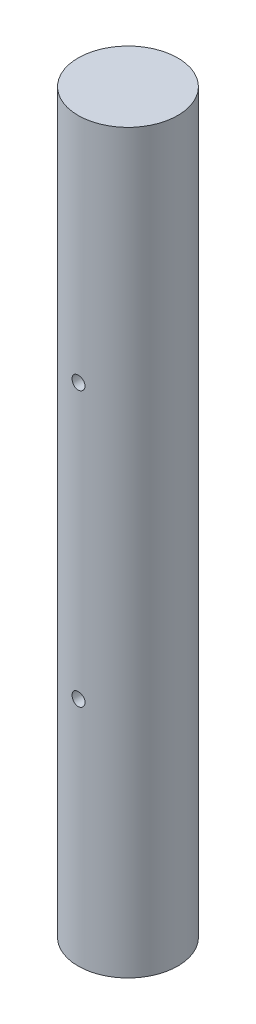
ISO-10303-21;
HEADER;
FILE_DESCRIPTION(('STEP AP214'),'2;1');
FILE_NAME('part.step','',(''),(''),'','','');
FILE_SCHEMA(('AUTOMOTIVE_DESIGN { 1 0 10303 214 1 1 1 1 }'));
ENDSEC;
DATA;
#1=APPLICATION_CONTEXT('core data for automotive mechanical design processes');
#2=APPLICATION_PROTOCOL_DEFINITION('international standard','automotive_design',2000,#1);
#3=PRODUCT_CONTEXT('',#1,'mechanical');
#4=PRODUCT('Part','Part','',(#3));
#5=PRODUCT_RELATED_PRODUCT_CATEGORY('part','',(#4));
#6=PRODUCT_DEFINITION_FORMATION('','',#4);
#7=PRODUCT_DEFINITION_CONTEXT('part definition',#1,'design');
#8=PRODUCT_DEFINITION('design','',#6,#7);
#9=PRODUCT_DEFINITION_SHAPE('','',#8);
#10=(LENGTH_UNIT() NAMED_UNIT(*) SI_UNIT(.MILLI.,.METRE.));
#11=(NAMED_UNIT(*) PLANE_ANGLE_UNIT() SI_UNIT($,.RADIAN.));
#12=(NAMED_UNIT(*) SI_UNIT($,.STERADIAN.) SOLID_ANGLE_UNIT());
#13=UNCERTAINTY_MEASURE_WITH_UNIT(LENGTH_MEASURE(1.E-05),#10,'distance_accuracy_value','');
#14=(GEOMETRIC_REPRESENTATION_CONTEXT(3) GLOBAL_UNCERTAINTY_ASSIGNED_CONTEXT((#13)) GLOBAL_UNIT_ASSIGNED_CONTEXT((#10,
#11,#12)) REPRESENTATION_CONTEXT('',''));
#15=CARTESIAN_POINT('',(0.,0.,0.));
#16=DIRECTION('',(0.,0.,1.));
#17=DIRECTION('',(1.,0.,0.));
#18=AXIS2_PLACEMENT_3D('',#15,#16,#17);
#19=CARTESIAN_POINT('',(0.,170.,0.));
#20=DIRECTION('',(0.,-1.,0.));
#21=DIRECTION('',(0.,0.,-1.));
#22=AXIS2_PLACEMENT_3D('',#19,#20,#21);
#23=CYLINDRICAL_SURFACE('',#22,11.5);
#24=CARTESIAN_POINT('',(0.,170.,0.));
#25=DIRECTION('',(0.,1.,0.));
#26=DIRECTION('',(0.,0.,1.));
#27=AXIS2_PLACEMENT_3D('',#24,#25,#26);
#28=CIRCLE('',#27,11.5);
#29=CARTESIAN_POINT('',(0.,170.,11.5));
#30=VERTEX_POINT('',#29);
#31=EDGE_CURVE('E10',#30,#30,#28,.T.);
#32=ORIENTED_EDGE('',*,*,#31,.F.);
#33=EDGE_LOOP('',(#32));
#34=FACE_BOUND('',#33,.T.);
#35=CARTESIAN_POINT('',(0.,0.,0.));
#36=DIRECTION('',(0.,1.,0.));
#37=DIRECTION('',(0.,0.,1.));
#38=AXIS2_PLACEMENT_3D('',#35,#36,#37);
#39=CIRCLE('',#38,11.5);
#40=CARTESIAN_POINT('',(0.,0.,11.5));
#41=VERTEX_POINT('',#40);
#42=EDGE_CURVE('E40',#41,#41,#39,.T.);
#43=ORIENTED_EDGE('',*,*,#42,.T.);
#44=EDGE_LOOP('',(#43));
#45=FACE_BOUND('',#44,.T.);
#46=CARTESIAN_POINT('',(-1.5,116.62,11.4017542509914));
#47=CARTESIAN_POINT('',(-1.4999964530145,116.703870253946,11.4017555010927));
#48=CARTESIAN_POINT('',(-1.49294203416221,116.787792174681,11.4026896606142));
#49=CARTESIAN_POINT('',(-1.46491333453698,116.953298276185,11.4063237260242));
#50=CARTESIAN_POINT('',(-1.44392470388228,117.034879956455,11.4090254521656));
#51=CARTESIAN_POINT('',(-1.3886587589991,117.193285481374,11.4158835494573));
#52=CARTESIAN_POINT('',(-1.3543907018073,117.27011259724,11.4200389070908));
#53=CARTESIAN_POINT('',(-1.27355889313978,117.416912256068,11.4293348464697));
#54=CARTESIAN_POINT('',(-1.22699716043964,117.486885921868,11.4344752664174));
#55=CARTESIAN_POINT('',(-1.12259656958886,117.618431613016,11.445197137233));
#56=CARTESIAN_POINT('',(-1.06469780379541,117.679955915402,11.450780832969));
#57=CARTESIAN_POINT('',(-0.939395748791598,117.792443921662,11.4617399588797));
#58=CARTESIAN_POINT('',(-0.871991977267106,117.843407089307,11.4671153784682));
#59=CARTESIAN_POINT('',(-0.729292001348488,117.933498448519,11.4770753814867));
#60=CARTESIAN_POINT('',(-0.653968201092626,117.972583280349,11.4816570418954));
#61=CARTESIAN_POINT('',(-0.49775603705431,118.037530666644,11.4894885821545));
#62=CARTESIAN_POINT('',(-0.416867897538944,118.06339375365,11.4927385156426));
#63=CARTESIAN_POINT('',(-0.252312093764229,118.101020439311,11.4975246059022));
#64=CARTESIAN_POINT('',(-0.168662889559627,118.112863522644,11.4990704204953));
#65=CARTESIAN_POINT('',(-0.000551051593625695,118.12236044931,11.5003071067839));
#66=CARTESIAN_POINT('',(0.0839115473355974,118.120014897574,11.4999980575609));
#67=CARTESIAN_POINT('',(0.250711499958829,118.10126463822,11.4975676318304));
#68=CARTESIAN_POINT('',(0.333058646852877,118.084945419878,11.495457275758));
#69=CARTESIAN_POINT('',(0.493835455554841,118.038844819273,11.4896737037343));
#70=CARTESIAN_POINT('',(0.57226503731604,118.009063162061,11.4860004558634));
#71=CARTESIAN_POINT('',(0.723243851165385,117.936792854226,11.4774848372199));
#72=CARTESIAN_POINT('',(0.795775273641194,117.894267411905,11.4726390893116));
#73=CARTESIAN_POINT('',(0.932704606534628,117.797743457546,11.4623201935655));
#74=CARTESIAN_POINT('',(0.997102110698513,117.743744372811,11.4568470144162));
#75=CARTESIAN_POINT('',(1.11643819513604,117.625327668657,11.4458372756446));
#76=CARTESIAN_POINT('',(1.17130282662102,117.560835515374,11.4403005474487));
#77=CARTESIAN_POINT('',(1.2694404810369,117.423518836851,11.4298278324284));
#78=CARTESIAN_POINT('',(1.31271346156177,117.35069428113,11.4248918478017));
#79=CARTESIAN_POINT('',(1.38644483776161,117.198711872973,11.4161795912173));
#80=CARTESIAN_POINT('',(1.41689697165318,117.119550948224,11.4124038861902));
#81=CARTESIAN_POINT('',(1.46405488015557,116.957178654247,11.4064505206358));
#82=CARTESIAN_POINT('',(1.48076137834162,116.87396749847,11.4042727759921));
#83=CARTESIAN_POINT('',(1.49985514370483,116.706510886248,11.4017774109739));
#84=CARTESIAN_POINT('',(1.50234663257981,116.622277507606,11.4014462521966));
#85=CARTESIAN_POINT('',(1.49321496203163,116.454594527588,11.4026457215703));
#86=CARTESIAN_POINT('',(1.48159213091645,116.371144908027,11.4041763064158));
#87=CARTESIAN_POINT('',(1.44464963434862,116.207712729944,11.4089144348313));
#88=CARTESIAN_POINT('',(1.41938072914779,116.127718501673,11.4121157621508));
#89=CARTESIAN_POINT('',(1.35591573806609,115.973102180079,11.4198296111094));
#90=CARTESIAN_POINT('',(1.31771916001083,115.898480291419,11.4243421826685));
#91=CARTESIAN_POINT('',(1.22922802110627,115.756256233103,11.4342023912125));
#92=CARTESIAN_POINT('',(1.17886529183313,115.688696804768,11.4395546717525));
#93=CARTESIAN_POINT('',(1.06756750174709,115.562952194031,11.4504767766229));
#94=CARTESIAN_POINT('',(1.00663199235395,115.504767409578,11.4560466101759));
#95=CARTESIAN_POINT('',(0.875462338341592,115.399055971119,11.4668179794224));
#96=CARTESIAN_POINT('',(0.805172669271244,115.351597920987,11.4720170065382));
#97=CARTESIAN_POINT('',(0.657558967858986,115.26916246459,11.4814231748458));
#98=CARTESIAN_POINT('',(0.58023508801516,115.234184787839,11.4856303375335));
#99=CARTESIAN_POINT('',(0.420973071168362,115.17781551552,11.4925676402684));
#100=CARTESIAN_POINT('',(0.339049006517444,115.156384706873,11.4953020399787));
#101=CARTESIAN_POINT('',(0.172727196515996,115.127590070284,11.4990034533124));
#102=CARTESIAN_POINT('',(0.0883295733447152,115.120225548735,11.4999705540811));
#103=CARTESIAN_POINT('',(-0.0798746769516696,115.119786301285,11.5000279000696));
#104=CARTESIAN_POINT('',(-0.163681043071274,115.126605959851,11.4991320170928));
#105=CARTESIAN_POINT('',(-0.328945491538632,115.15411725394,11.4955917059201));
#106=CARTESIAN_POINT('',(-0.410403576567152,115.174808873627,11.4929472797203));
#107=CARTESIAN_POINT('',(-0.568642219855312,115.229442666214,11.4862056490748));
#108=CARTESIAN_POINT('',(-0.645424712431703,115.263379315928,11.4821090502512));
#109=CARTESIAN_POINT('',(-0.792221787328591,115.343528862326,11.4729159452671));
#110=CARTESIAN_POINT('',(-0.862236260369657,115.389741957187,11.4678194229654));
#111=CARTESIAN_POINT('',(-0.994048728546034,115.49352165619,11.4571496362498));
#112=CARTESIAN_POINT('',(-1.05578467493496,115.551166752347,11.4515732358814));
#113=CARTESIAN_POINT('',(-1.16874758745896,115.676010301249,11.4405969587125));
#114=CARTESIAN_POINT('',(-1.2199720669361,115.743211008177,11.4351971239349));
#115=CARTESIAN_POINT('',(-1.31064441090517,115.885584353483,11.425161148306));
#116=CARTESIAN_POINT('',(-1.35004186374931,115.960789316626,11.4205283132887));
#117=CARTESIAN_POINT('',(-1.41559127347486,116.116767835354,11.4125895944072));
#118=CARTESIAN_POINT('',(-1.44175750369104,116.197535282977,11.4092822814234));
#119=CARTESIAN_POINT('',(-1.47390259785781,116.335591798641,11.4051643222105));
#120=CARTESIAN_POINT('',(-1.48367487173576,116.392013413575,11.4038919959272));
#121=CARTESIAN_POINT('',(-1.49672475464482,116.505615344829,11.4021865375875));
#122=CARTESIAN_POINT('',(-1.50000241924847,116.562795654653,11.4017533983503));
#123=CARTESIAN_POINT('',(-1.5,116.62,11.4017542509914));
#124=B_SPLINE_CURVE_WITH_KNOTS('',3,(#46,#47,#48,#49,#50,#51,#52,#53,#54,#55,#56,#57,#58,#59,
#60,#61,#62,#63,#64,#65,#66,#67,#68,#69,#70,#71,#72,#73,#74,#75,#76,#77,#78,#79,#80,#81,#82,#83,
#84,#85,#86,#87,#88,#89,#90,#91,#92,#93,#94,#95,#96,#97,#98,#99,#100,#101,#102,#103,#104,#105,
#106,#107,#108,#109,#110,#111,#112,#113,#114,#115,#116,#117,#118,#119,#120,#121,#122,#123),
.UNSPECIFIED.,.T.,.F.,(4,2,2,2,2,2,2,2,2,2,2,2,2,2,2,2,2,2,2,2,2,2,2,2,2,2,2,2,2,2,2,2,2,2,2,2,
2,2,4),(0.,0.251401763409767,0.503062830563605,0.75454878043405,1.00599345881712,
1.25880454908431,1.51162847240694,1.76536449581032,2.01909029853276,2.27137063822619,
2.52364022208435,2.77437738752205,3.0251196741212,3.27659295200132,3.5280787849124,
3.7814359080699,4.03479395807763,4.28827560662901,4.54174391096105,4.79335142269096,
5.04495308198345,5.29562522352573,5.54630690957675,5.79842717499932,6.05055813995757,
6.30425867142355,6.55795370410216,6.81091098132409,7.0638557849315,7.31492390374274,
7.56599173592654,7.81695498432957,8.06792228421935,8.32067641903952,8.57349027819167,
8.82736691371985,9.08096908946925,9.25244104378408,9.42391153085533),.UNSPECIFIED.);
#125=CARTESIAN_POINT('',(-1.5,116.62,11.4017542509914));
#126=VERTEX_POINT('',#125);
#127=EDGE_CURVE('E51',#126,#126,#124,.T.);
#128=ORIENTED_EDGE('',*,*,#127,.T.);
#129=EDGE_LOOP('',(#128));
#130=FACE_BOUND('',#129,.T.);
#131=CARTESIAN_POINT('',(-1.5,53.38,11.4017542509914));
#132=CARTESIAN_POINT('',(-1.49999645301449,53.4638702539465,11.4017555010927));
#133=CARTESIAN_POINT('',(-1.49294203416221,53.5477921746807,11.4026896606142));
#134=CARTESIAN_POINT('',(-1.46491333453698,53.7132982761849,11.4063237260242));
#135=CARTESIAN_POINT('',(-1.44392470388228,53.7948799564552,11.4090254521656));
#136=CARTESIAN_POINT('',(-1.3886587589991,53.953285481374,11.4158835494573));
#137=CARTESIAN_POINT('',(-1.3543907018073,54.0301125972402,11.4200389070908));
#138=CARTESIAN_POINT('',(-1.27355889313978,54.1769122560682,11.4293348464697));
#139=CARTESIAN_POINT('',(-1.22699716043964,54.2468859218683,11.4344752664174));
#140=CARTESIAN_POINT('',(-1.12259656958886,54.3784316130163,11.445197137233));
#141=CARTESIAN_POINT('',(-1.06469780379541,54.4399559154016,11.450780832969));
#142=CARTESIAN_POINT('',(-0.93939574879159,54.5524439216618,11.4617399588797));
#143=CARTESIAN_POINT('',(-0.871991977267098,54.603407089307,11.4671153784682));
#144=CARTESIAN_POINT('',(-0.72929200134848,54.693498448519,11.4770753814867));
#145=CARTESIAN_POINT('',(-0.653968201092619,54.7325832803487,11.4816570418954));
#146=CARTESIAN_POINT('',(-0.497756037054305,54.7975306666442,11.4894885821545));
#147=CARTESIAN_POINT('',(-0.41686789753894,54.82339375365,11.4927385156426));
#148=CARTESIAN_POINT('',(-0.252312093764225,54.8610204393109,11.4975246059022));
#149=CARTESIAN_POINT('',(-0.168662889559623,54.8728635226436,11.4990704204953));
#150=CARTESIAN_POINT('',(-0.000551051593620342,54.8823604493104,11.5003071067839));
#151=CARTESIAN_POINT('',(0.0839115473356037,54.8800148975735,11.4999980575609));
#152=CARTESIAN_POINT('',(0.250711499958836,54.8612646382203,11.4975676318304));
#153=CARTESIAN_POINT('',(0.333058646852885,54.8449454198778,11.495457275758));
#154=CARTESIAN_POINT('',(0.493835455554849,54.7988448192731,11.4896737037343));
#155=CARTESIAN_POINT('',(0.572265037316048,54.7690631620608,11.4860004558634));
#156=CARTESIAN_POINT('',(0.723243851165393,54.696792854226,11.4774848372199));
#157=CARTESIAN_POINT('',(0.795775273641201,54.6542674119045,11.4726390893116));
#158=CARTESIAN_POINT('',(0.932704606534633,54.5577434575456,11.4623201935655));
#159=CARTESIAN_POINT('',(0.997102110698518,54.5037443728108,11.4568470144162));
#160=CARTESIAN_POINT('',(1.11643819513605,54.3853276686567,11.4458372756446));
#161=CARTESIAN_POINT('',(1.17130282662102,54.3208355153735,11.4403005474487));
#162=CARTESIAN_POINT('',(1.2694404810369,54.1835188368507,11.4298278324284));
#163=CARTESIAN_POINT('',(1.31271346156177,54.1106942811298,11.4248918478017));
#164=CARTESIAN_POINT('',(1.38644483776161,53.9587118729726,11.4161795912173));
#165=CARTESIAN_POINT('',(1.41689697165318,53.8795509482236,11.4124038861902));
#166=CARTESIAN_POINT('',(1.46405488015557,53.7171786542471,11.4064505206358));
#167=CARTESIAN_POINT('',(1.48076137834162,53.6339674984697,11.4042727759921));
#168=CARTESIAN_POINT('',(1.49985514370483,53.4665108862484,11.4017774109739));
#169=CARTESIAN_POINT('',(1.50234663257981,53.3822775076062,11.4014462521966));
#170=CARTESIAN_POINT('',(1.49321496203163,53.2145945275883,11.4026457215703));
#171=CARTESIAN_POINT('',(1.48159213091645,53.1311449080275,11.4041763064158));
#172=CARTESIAN_POINT('',(1.44464963434861,52.9677127299436,11.4089144348313));
#173=CARTESIAN_POINT('',(1.41938072914779,52.8877185016734,11.4121157621508));
#174=CARTESIAN_POINT('',(1.35591573806608,52.7331021800793,11.4198296111094));
#175=CARTESIAN_POINT('',(1.31771916001082,52.6584802914188,11.4243421826685));
#176=CARTESIAN_POINT('',(1.22922802110626,52.5162562331029,11.4342023912125));
#177=CARTESIAN_POINT('',(1.17886529183312,52.4486968047681,11.4395546717525));
#178=CARTESIAN_POINT('',(1.06756750174708,52.3229521940314,11.4504767766229));
#179=CARTESIAN_POINT('',(1.00663199235394,52.2647674095775,11.4560466101759));
#180=CARTESIAN_POINT('',(0.875462338341591,52.1590559711191,11.4668179794224));
#181=CARTESIAN_POINT('',(0.805172669271245,52.1115979209871,11.4720170065382));
#182=CARTESIAN_POINT('',(0.657558967858985,52.0291624645904,11.4814231748458));
#183=CARTESIAN_POINT('',(0.580235088015156,51.9941847878385,11.4856303375335));
#184=CARTESIAN_POINT('',(0.420973071168353,51.9378155155198,11.4925676402684));
#185=CARTESIAN_POINT('',(0.339049006517435,51.9163847068729,11.4953020399787));
#186=CARTESIAN_POINT('',(0.172727196515986,51.8875900702839,11.4990034533124));
#187=CARTESIAN_POINT('',(0.0883295733447042,51.880225548735,11.4999705540811));
#188=CARTESIAN_POINT('',(-0.0798746769516816,51.8797863012849,11.5000279000696));
#189=CARTESIAN_POINT('',(-0.163681043071287,51.8866059598506,11.4991320170928));
#190=CARTESIAN_POINT('',(-0.328945491538643,51.9141172539398,11.4955917059201));
#191=CARTESIAN_POINT('',(-0.410403576567161,51.9348088736267,11.4929472797203));
#192=CARTESIAN_POINT('',(-0.568642219855318,51.9894426662137,11.4862056490748));
#193=CARTESIAN_POINT('',(-0.645424712431709,52.0233793159276,11.4821090502512));
#194=CARTESIAN_POINT('',(-0.792221787328597,52.1035288623262,11.4729159452671));
#195=CARTESIAN_POINT('',(-0.862236260369664,52.1497419571867,11.4678194229654));
#196=CARTESIAN_POINT('',(-0.99404872854604,52.25352165619,11.4571496362498));
#197=CARTESIAN_POINT('',(-1.05578467493496,52.3111667523472,11.4515732358814));
#198=CARTESIAN_POINT('',(-1.16874758745896,52.4360103012487,11.4405969587125));
#199=CARTESIAN_POINT('',(-1.2199720669361,52.5032110081769,11.4351971239349));
#200=CARTESIAN_POINT('',(-1.31064441090517,52.6455843534833,11.425161148306));
#201=CARTESIAN_POINT('',(-1.35004186374931,52.7207893166265,11.4205283132887));
#202=CARTESIAN_POINT('',(-1.41559127347487,52.8767678353541,11.4125895944072));
#203=CARTESIAN_POINT('',(-1.44175750369104,52.9575352829766,11.4092822814234));
#204=CARTESIAN_POINT('',(-1.47390259785781,53.0955917986414,11.4051643222105));
#205=CARTESIAN_POINT('',(-1.48367487173576,53.1520134135752,11.4038919959272));
#206=CARTESIAN_POINT('',(-1.49672475464482,53.265615344829,11.4021865375875));
#207=CARTESIAN_POINT('',(-1.50000241924847,53.3227956546528,11.4017533983503));
#208=CARTESIAN_POINT('',(-1.5,53.38,11.4017542509914));
#209=B_SPLINE_CURVE_WITH_KNOTS('',3,(#131,#132,#133,#134,#135,#136,#137,#138,#139,#140,#141,
#142,#143,#144,#145,#146,#147,#148,#149,#150,#151,#152,#153,#154,#155,#156,#157,#158,#159,#160,
#161,#162,#163,#164,#165,#166,#167,#168,#169,#170,#171,#172,#173,#174,#175,#176,#177,#178,#179,
#180,#181,#182,#183,#184,#185,#186,#187,#188,#189,#190,#191,#192,#193,#194,#195,#196,#197,#198,
#199,#200,#201,#202,#203,#204,#205,#206,#207,#208),.UNSPECIFIED.,.T.,.F.,(4,2,2,2,2,2,2,2,2,2,2,
2,2,2,2,2,2,2,2,2,2,2,2,2,2,2,2,2,2,2,2,2,2,2,2,2,2,2,4),(0.,0.251401763409774,
0.503062830563613,0.754548780434044,1.00599345881713,1.25880454908432,1.51162847240695,
1.76536449581033,2.01909029853277,2.27137063822619,2.52364022208436,2.77437738752206,
3.0251196741212,3.27659295200133,3.52807878491241,3.78143590806991,4.03479395807764,
4.28827560662902,4.54174391096107,4.79335142269097,5.04495308198347,5.29562522352575,
5.54630690957678,5.79842717499935,6.05055813995759,6.30425867142356,6.55795370410218,
6.8109109813241,7.06385578493152,7.31492390374276,7.56599173592655,7.81695498432958,
8.06792228421936,8.32067641903952,8.57349027819169,8.82736691371987,9.08096908946928,
9.25244104378408,9.42391153085534),.UNSPECIFIED.);
#210=CARTESIAN_POINT('',(-1.5,53.38,11.4017542509914));
#211=VERTEX_POINT('',#210);
#212=EDGE_CURVE('E88',#211,#211,#209,.T.);
#213=ORIENTED_EDGE('',*,*,#212,.T.);
#214=EDGE_LOOP('',(#213));
#215=FACE_BOUND('',#214,.T.);
#216=ADVANCED_FACE('F37',(#34,#45,#130,#215),#23,.T.);
#217=CARTESIAN_POINT('',(0.,170.,0.));
#218=DIRECTION('',(0.,1.,0.));
#219=DIRECTION('',(0.,0.,1.));
#220=AXIS2_PLACEMENT_3D('',#217,#218,#219);
#221=PLANE('',#220);
#222=ORIENTED_EDGE('',*,*,#31,.T.);
#223=EDGE_LOOP('',(#222));
#224=FACE_BOUND('',#223,.T.);
#225=ADVANCED_FACE('F67',(#224),#221,.T.);
#226=CARTESIAN_POINT('',(0.,0.,0.));
#227=DIRECTION('',(0.,1.,0.));
#228=DIRECTION('',(0.,0.,1.));
#229=AXIS2_PLACEMENT_3D('',#226,#227,#228);
#230=PLANE('',#229);
#231=ORIENTED_EDGE('',*,*,#42,.F.);
#232=EDGE_LOOP('',(#231));
#233=FACE_BOUND('',#232,.T.);
#234=ADVANCED_FACE('F69',(#233),#230,.F.);
#235=CARTESIAN_POINT('',(0.,116.62,0.));
#236=DIRECTION('',(0.,0.,-1.));
#237=DIRECTION('',(-1.,0.,0.));
#238=AXIS2_PLACEMENT_3D('',#235,#236,#237);
#239=PLANE('',#238);
#240=CARTESIAN_POINT('',(0.,116.62,0.));
#241=DIRECTION('',(0.,0.,1.));
#242=DIRECTION('',(-1.,0.,0.));
#243=AXIS2_PLACEMENT_3D('',#240,#241,#242);
#244=CIRCLE('',#243,1.5);
#245=CARTESIAN_POINT('',(-1.5,116.62,0.));
#246=VERTEX_POINT('',#245);
#247=EDGE_CURVE('E60',#246,#246,#244,.T.);
#248=ORIENTED_EDGE('',*,*,#247,.T.);
#249=EDGE_LOOP('',(#248));
#250=FACE_BOUND('',#249,.T.);
#251=ADVANCED_FACE('F71',(#250),#239,.F.);
#252=CARTESIAN_POINT('',(0.,116.62,11.501));
#253=DIRECTION('',(0.,0.,-1.));
#254=DIRECTION('',(-1.,0.,0.));
#255=AXIS2_PLACEMENT_3D('',#252,#253,#254);
#256=CYLINDRICAL_SURFACE('',#255,1.5);
#257=ORIENTED_EDGE('',*,*,#127,.F.);
#258=EDGE_LOOP('',(#257));
#259=FACE_BOUND('',#258,.T.);
#260=ORIENTED_EDGE('',*,*,#247,.F.);
#261=EDGE_LOOP('',(#260));
#262=FACE_BOUND('',#261,.T.);
#263=ADVANCED_FACE('F62',(#259,#262),#256,.F.);
#264=CARTESIAN_POINT('',(0.,53.38,0.));
#265=DIRECTION('',(0.,0.,1.));
#266=DIRECTION('',(1.,0.,0.));
#267=AXIS2_PLACEMENT_3D('',#264,#265,#266);
#268=PLANE('',#267);
#269=CARTESIAN_POINT('',(0.,53.38,0.));
#270=DIRECTION('',(0.,0.,1.));
#271=DIRECTION('',(1.,0.,0.));
#272=AXIS2_PLACEMENT_3D('',#269,#270,#271);
#273=CIRCLE('',#272,1.5);
#274=CARTESIAN_POINT('',(1.5,53.38,0.));
#275=VERTEX_POINT('',#274);
#276=EDGE_CURVE('E49',#275,#275,#273,.T.);
#277=ORIENTED_EDGE('',*,*,#276,.T.);
#278=EDGE_LOOP('',(#277));
#279=FACE_BOUND('',#278,.T.);
#280=ADVANCED_FACE('F106',(#279),#268,.T.);
#281=CARTESIAN_POINT('',(0.,53.38,11.501));
#282=DIRECTION('',(0.,0.,-1.));
#283=DIRECTION('',(-1.,0.,0.));
#284=AXIS2_PLACEMENT_3D('',#281,#282,#283);
#285=CYLINDRICAL_SURFACE('',#284,1.5);
#286=ORIENTED_EDGE('',*,*,#212,.F.);
#287=EDGE_LOOP('',(#286));
#288=FACE_BOUND('',#287,.T.);
#289=ORIENTED_EDGE('',*,*,#276,.F.);
#290=EDGE_LOOP('',(#289));
#291=FACE_BOUND('',#290,.T.);
#292=ADVANCED_FACE('F101',(#288,#291),#285,.F.);
#293=CLOSED_SHELL('',(#216,#225,#234,#251,#263,#280,#292));
#294=MANIFOLD_SOLID_BREP('B2',#293);
#295=ADVANCED_BREP_SHAPE_REPRESENTATION('',(#18,#294),#14);
#296=SHAPE_DEFINITION_REPRESENTATION(#9,#295);
ENDSEC;
END-ISO-10303-21;
